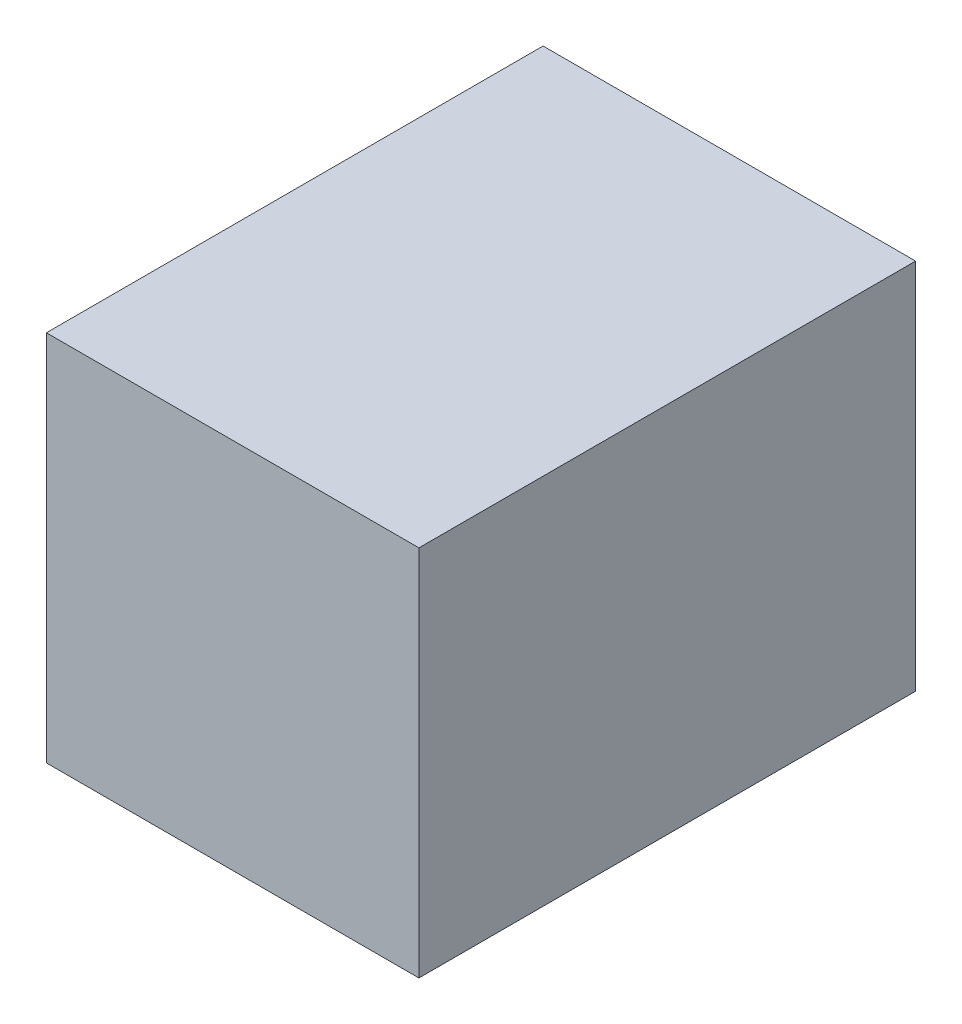
ISO-10303-21;
HEADER;
FILE_DESCRIPTION(('STEP AP214'),'2;1');
FILE_NAME('part.step','',(''),(''),'','','');
FILE_SCHEMA(('AUTOMOTIVE_DESIGN { 1 0 10303 214 1 1 1 1 }'));
ENDSEC;
DATA;
#1=APPLICATION_CONTEXT('core data for automotive mechanical design processes');
#2=APPLICATION_PROTOCOL_DEFINITION('international standard','automotive_design',2000,#1);
#3=PRODUCT_CONTEXT('',#1,'mechanical');
#4=PRODUCT('Part','Part','',(#3));
#5=PRODUCT_RELATED_PRODUCT_CATEGORY('part','',(#4));
#6=PRODUCT_DEFINITION_FORMATION('','',#4);
#7=PRODUCT_DEFINITION_CONTEXT('part definition',#1,'design');
#8=PRODUCT_DEFINITION('design','',#6,#7);
#9=PRODUCT_DEFINITION_SHAPE('','',#8);
#10=(LENGTH_UNIT() NAMED_UNIT(*) SI_UNIT(.MILLI.,.METRE.));
#11=(NAMED_UNIT(*) PLANE_ANGLE_UNIT() SI_UNIT($,.RADIAN.));
#12=(NAMED_UNIT(*) SI_UNIT($,.STERADIAN.) SOLID_ANGLE_UNIT());
#13=UNCERTAINTY_MEASURE_WITH_UNIT(LENGTH_MEASURE(1.E-05),#10,'distance_accuracy_value','');
#14=(GEOMETRIC_REPRESENTATION_CONTEXT(3) GLOBAL_UNCERTAINTY_ASSIGNED_CONTEXT((#13)) GLOBAL_UNIT_ASSIGNED_CONTEXT((#10,
#11,#12)) REPRESENTATION_CONTEXT('',''));
#15=CARTESIAN_POINT('',(0.,0.,0.));
#16=DIRECTION('',(0.,0.,1.));
#17=DIRECTION('',(1.,0.,0.));
#18=AXIS2_PLACEMENT_3D('',#15,#16,#17);
#19=CARTESIAN_POINT('',(0.,0.,12.7));
#20=DIRECTION('',(1.,0.,0.));
#21=DIRECTION('',(0.,1.,0.));
#22=AXIS2_PLACEMENT_3D('',#19,#20,#21);
#23=PLANE('',#22);
#24=DIRECTION('',(0.,-1.,0.));
#25=VECTOR('',#24,1.);
#26=CARTESIAN_POINT('',(0.,0.,0.));
#27=LINE('',#26,#25);
#28=CARTESIAN_POINT('',(0.,9.525,0.));
#29=VERTEX_POINT('',#28);
#30=CARTESIAN_POINT('',(0.,0.,0.));
#31=VERTEX_POINT('',#30);
#32=EDGE_CURVE('E98',#29,#31,#27,.T.);
#33=ORIENTED_EDGE('',*,*,#32,.T.);
#34=DIRECTION('',(0.,0.,-1.));
#35=VECTOR('',#34,1.);
#36=CARTESIAN_POINT('',(0.,0.,12.7));
#37=LINE('',#36,#35);
#38=CARTESIAN_POINT('',(0.,0.,12.7));
#39=VERTEX_POINT('',#38);
#40=EDGE_CURVE('E11',#39,#31,#37,.T.);
#41=ORIENTED_EDGE('',*,*,#40,.F.);
#42=DIRECTION('',(0.,-1.,0.));
#43=VECTOR('',#42,1.);
#44=CARTESIAN_POINT('',(0.,0.,12.7));
#45=LINE('',#44,#43);
#46=CARTESIAN_POINT('',(0.,9.525,12.7));
#47=VERTEX_POINT('',#46);
#48=EDGE_CURVE('E86',#47,#39,#45,.T.);
#49=ORIENTED_EDGE('',*,*,#48,.F.);
#50=DIRECTION('',(0.,0.,-1.));
#51=VECTOR('',#50,1.);
#52=CARTESIAN_POINT('',(0.,9.525,12.7));
#53=LINE('',#52,#51);
#54=EDGE_CURVE('E94',#47,#29,#53,.T.);
#55=ORIENTED_EDGE('',*,*,#54,.T.);
#56=EDGE_LOOP('',(#33,#41,#49,#55));
#57=FACE_BOUND('',#56,.T.);
#58=ADVANCED_FACE('F35',(#57),#23,.F.);
#59=CARTESIAN_POINT('',(0.,0.,12.7));
#60=DIRECTION('',(0.,1.,0.));
#61=DIRECTION('',(0.,0.,1.));
#62=AXIS2_PLACEMENT_3D('',#59,#60,#61);
#63=PLANE('',#62);
#64=DIRECTION('',(1.,0.,0.));
#65=VECTOR('',#64,1.);
#66=CARTESIAN_POINT('',(0.,0.,0.));
#67=LINE('',#66,#65);
#68=CARTESIAN_POINT('',(9.525,0.,0.));
#69=VERTEX_POINT('',#68);
#70=EDGE_CURVE('E90',#31,#69,#67,.T.);
#71=ORIENTED_EDGE('',*,*,#70,.T.);
#72=DIRECTION('',(0.,0.,-1.));
#73=VECTOR('',#72,1.);
#74=CARTESIAN_POINT('',(9.525,0.,12.7));
#75=LINE('',#74,#73);
#76=CARTESIAN_POINT('',(9.525,0.,12.7));
#77=VERTEX_POINT('',#76);
#78=EDGE_CURVE('E43',#77,#69,#75,.T.);
#79=ORIENTED_EDGE('',*,*,#78,.F.);
#80=DIRECTION('',(1.,0.,0.));
#81=VECTOR('',#80,1.);
#82=CARTESIAN_POINT('',(0.,0.,12.7));
#83=LINE('',#82,#81);
#84=EDGE_CURVE('E81',#39,#77,#83,.T.);
#85=ORIENTED_EDGE('',*,*,#84,.F.);
#86=ORIENTED_EDGE('',*,*,#40,.T.);
#87=EDGE_LOOP('',(#71,#79,#85,#86));
#88=FACE_BOUND('',#87,.T.);
#89=ADVANCED_FACE('F89',(#88),#63,.F.);
#90=CARTESIAN_POINT('',(9.525,0.,12.7));
#91=DIRECTION('',(-1.,0.,0.));
#92=DIRECTION('',(0.,0.,1.));
#93=AXIS2_PLACEMENT_3D('',#90,#91,#92);
#94=PLANE('',#93);
#95=DIRECTION('',(0.,1.,0.));
#96=VECTOR('',#95,1.);
#97=CARTESIAN_POINT('',(9.525,0.,0.));
#98=LINE('',#97,#96);
#99=CARTESIAN_POINT('',(9.525,9.525,0.));
#100=VERTEX_POINT('',#99);
#101=EDGE_CURVE('E68',#69,#100,#98,.T.);
#102=ORIENTED_EDGE('',*,*,#101,.T.);
#103=DIRECTION('',(0.,0.,-1.));
#104=VECTOR('',#103,1.);
#105=CARTESIAN_POINT('',(9.525,9.525,12.7));
#106=LINE('',#105,#104);
#107=CARTESIAN_POINT('',(9.525,9.525,12.7));
#108=VERTEX_POINT('',#107);
#109=EDGE_CURVE('E91',#108,#100,#106,.T.);
#110=ORIENTED_EDGE('',*,*,#109,.F.);
#111=DIRECTION('',(0.,1.,0.));
#112=VECTOR('',#111,1.);
#113=CARTESIAN_POINT('',(9.525,0.,12.7));
#114=LINE('',#113,#112);
#115=EDGE_CURVE('E84',#77,#108,#114,.T.);
#116=ORIENTED_EDGE('',*,*,#115,.F.);
#117=ORIENTED_EDGE('',*,*,#78,.T.);
#118=EDGE_LOOP('',(#102,#110,#116,#117));
#119=FACE_BOUND('',#118,.T.);
#120=ADVANCED_FACE('F92',(#119),#94,.F.);
#121=CARTESIAN_POINT('',(0.,9.525,12.7));
#122=DIRECTION('',(0.,-1.,0.));
#123=DIRECTION('',(0.,0.,-1.));
#124=AXIS2_PLACEMENT_3D('',#121,#122,#123);
#125=PLANE('',#124);
#126=DIRECTION('',(-1.,0.,0.));
#127=VECTOR('',#126,1.);
#128=CARTESIAN_POINT('',(0.,9.525,0.));
#129=LINE('',#128,#127);
#130=EDGE_CURVE('E74',#100,#29,#129,.T.);
#131=ORIENTED_EDGE('',*,*,#130,.T.);
#132=ORIENTED_EDGE('',*,*,#54,.F.);
#133=DIRECTION('',(-1.,0.,0.));
#134=VECTOR('',#133,1.);
#135=CARTESIAN_POINT('',(0.,9.525,12.7));
#136=LINE('',#135,#134);
#137=EDGE_CURVE('E51',#108,#47,#136,.T.);
#138=ORIENTED_EDGE('',*,*,#137,.F.);
#139=ORIENTED_EDGE('',*,*,#109,.T.);
#140=EDGE_LOOP('',(#131,#132,#138,#139));
#141=FACE_BOUND('',#140,.T.);
#142=ADVANCED_FACE('F105',(#141),#125,.F.);
#143=CARTESIAN_POINT('',(0.,0.,12.7));
#144=DIRECTION('',(0.,0.,-1.));
#145=DIRECTION('',(-1.,0.,0.));
#146=AXIS2_PLACEMENT_3D('',#143,#144,#145);
#147=PLANE('',#146);
#148=ORIENTED_EDGE('',*,*,#48,.T.);
#149=ORIENTED_EDGE('',*,*,#84,.T.);
#150=ORIENTED_EDGE('',*,*,#115,.T.);
#151=ORIENTED_EDGE('',*,*,#137,.T.);
#152=EDGE_LOOP('',(#148,#149,#150,#151));
#153=FACE_BOUND('',#152,.T.);
#154=ADVANCED_FACE('F82',(#153),#147,.F.);
#155=CARTESIAN_POINT('',(0.,0.,0.));
#156=DIRECTION('',(0.,0.,-1.));
#157=DIRECTION('',(-1.,0.,0.));
#158=AXIS2_PLACEMENT_3D('',#155,#156,#157);
#159=PLANE('',#158);
#160=ORIENTED_EDGE('',*,*,#32,.F.);
#161=ORIENTED_EDGE('',*,*,#130,.F.);
#162=ORIENTED_EDGE('',*,*,#101,.F.);
#163=ORIENTED_EDGE('',*,*,#70,.F.);
#164=EDGE_LOOP('',(#160,#161,#162,#163));
#165=FACE_BOUND('',#164,.T.);
#166=ADVANCED_FACE('F108',(#165),#159,.T.);
#167=CLOSED_SHELL('',(#58,#89,#120,#142,#154,#166));
#168=MANIFOLD_SOLID_BREP('B2',#167);
#169=ADVANCED_BREP_SHAPE_REPRESENTATION('',(#18,#168),#14);
#170=SHAPE_DEFINITION_REPRESENTATION(#9,#169);
ENDSEC;
END-ISO-10303-21;
